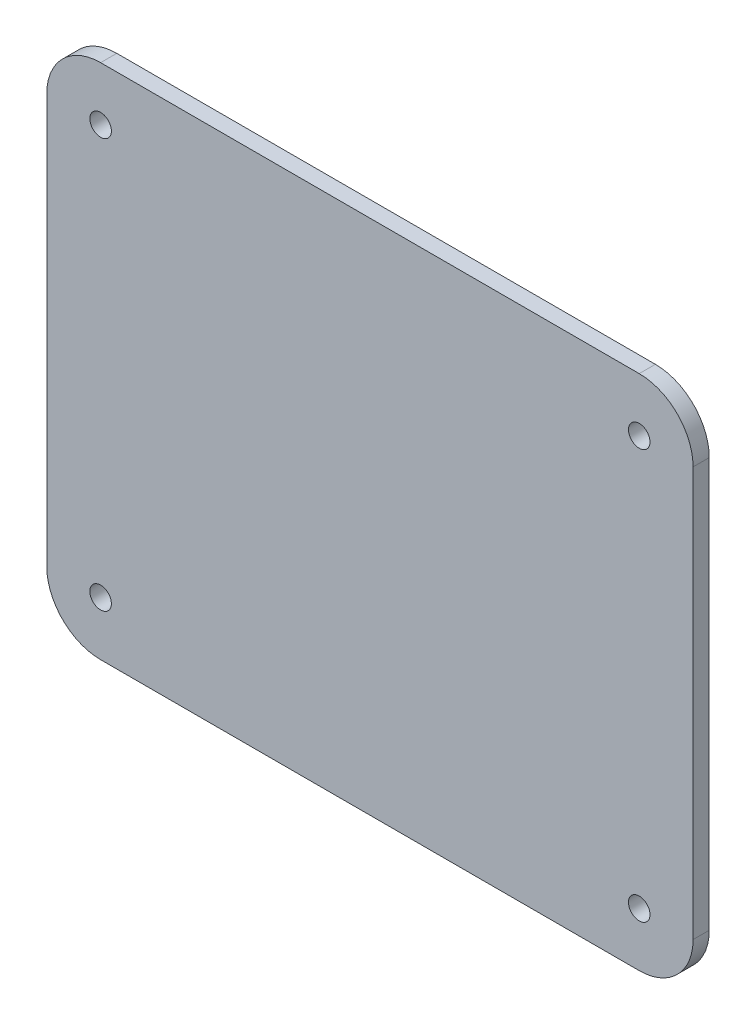
ISO-10303-21;
HEADER;
FILE_DESCRIPTION(('STEP AP214'),'2;1');
FILE_NAME('part.step','',(''),(''),'','','');
FILE_SCHEMA(('AUTOMOTIVE_DESIGN { 1 0 10303 214 1 1 1 1 }'));
ENDSEC;
DATA;
#1=APPLICATION_CONTEXT('core data for automotive mechanical design processes');
#2=APPLICATION_PROTOCOL_DEFINITION('international standard','automotive_design',2000,#1);
#3=PRODUCT_CONTEXT('',#1,'mechanical');
#4=PRODUCT('Part','Part','',(#3));
#5=PRODUCT_RELATED_PRODUCT_CATEGORY('part','',(#4));
#6=PRODUCT_DEFINITION_FORMATION('','',#4);
#7=PRODUCT_DEFINITION_CONTEXT('part definition',#1,'design');
#8=PRODUCT_DEFINITION('design','',#6,#7);
#9=PRODUCT_DEFINITION_SHAPE('','',#8);
#10=(LENGTH_UNIT() NAMED_UNIT(*) SI_UNIT(.MILLI.,.METRE.));
#11=(NAMED_UNIT(*) PLANE_ANGLE_UNIT() SI_UNIT($,.RADIAN.));
#12=(NAMED_UNIT(*) SI_UNIT($,.STERADIAN.) SOLID_ANGLE_UNIT());
#13=UNCERTAINTY_MEASURE_WITH_UNIT(LENGTH_MEASURE(1.E-05),#10,'distance_accuracy_value','');
#14=(GEOMETRIC_REPRESENTATION_CONTEXT(3) GLOBAL_UNCERTAINTY_ASSIGNED_CONTEXT((#13)) GLOBAL_UNIT_ASSIGNED_CONTEXT((#10,
#11,#12)) REPRESENTATION_CONTEXT('',''));
#15=CARTESIAN_POINT('',(0.,0.,0.));
#16=DIRECTION('',(0.,0.,1.));
#17=DIRECTION('',(1.,0.,0.));
#18=AXIS2_PLACEMENT_3D('',#15,#16,#17);
#19=CARTESIAN_POINT('',(-50.,38.,3.));
#20=DIRECTION('',(0.,0.,1.));
#21=DIRECTION('',(1.,0.,0.));
#22=AXIS2_PLACEMENT_3D('',#19,#20,#21);
#23=PLANE('',#22);
#24=CARTESIAN_POINT('',(50.,-38.,3.));
#25=DIRECTION('',(0.,0.,1.));
#26=DIRECTION('',(1.,0.,0.));
#27=AXIS2_PLACEMENT_3D('',#24,#25,#26);
#28=CIRCLE('',#27,2.);
#29=CARTESIAN_POINT('',(52.,-38.,3.));
#30=VERTEX_POINT('',#29);
#31=EDGE_CURVE('E188',#30,#30,#28,.T.);
#32=ORIENTED_EDGE('',*,*,#31,.F.);
#33=EDGE_LOOP('',(#32));
#34=FACE_BOUND('',#33,.T.);
#35=CARTESIAN_POINT('',(50.,38.,3.));
#36=DIRECTION('',(0.,0.,1.));
#37=DIRECTION('',(1.,0.,0.));
#38=AXIS2_PLACEMENT_3D('',#35,#36,#37);
#39=CIRCLE('',#38,2.);
#40=CARTESIAN_POINT('',(52.,38.,3.));
#41=VERTEX_POINT('',#40);
#42=EDGE_CURVE('E134',#41,#41,#39,.T.);
#43=ORIENTED_EDGE('',*,*,#42,.F.);
#44=EDGE_LOOP('',(#43));
#45=FACE_BOUND('',#44,.T.);
#46=CARTESIAN_POINT('',(-50.,38.,3.));
#47=DIRECTION('',(0.,0.,1.));
#48=DIRECTION('',(1.,0.,0.));
#49=AXIS2_PLACEMENT_3D('',#46,#47,#48);
#50=CIRCLE('',#49,10.);
#51=CARTESIAN_POINT('',(-49.9999999999999,48.,3.));
#52=VERTEX_POINT('',#51);
#53=CARTESIAN_POINT('',(-60.,37.9999999999999,3.));
#54=VERTEX_POINT('',#53);
#55=EDGE_CURVE('E145',#52,#54,#50,.T.);
#56=ORIENTED_EDGE('',*,*,#55,.T.);
#57=DIRECTION('',(0.,-1.,0.));
#58=VECTOR('',#57,1.);
#59=CARTESIAN_POINT('',(-60.,37.9999999999999,3.));
#60=LINE('',#59,#58);
#61=CARTESIAN_POINT('',(-60.,-37.9999999999999,3.));
#62=VERTEX_POINT('',#61);
#63=EDGE_CURVE('E93',#54,#62,#60,.T.);
#64=ORIENTED_EDGE('',*,*,#63,.T.);
#65=CARTESIAN_POINT('',(-50.,-38.,3.));
#66=DIRECTION('',(0.,0.,1.));
#67=DIRECTION('',(1.,0.,0.));
#68=AXIS2_PLACEMENT_3D('',#65,#66,#67);
#69=CIRCLE('',#68,10.);
#70=CARTESIAN_POINT('',(-49.9999999999999,-48.,3.));
#71=VERTEX_POINT('',#70);
#72=EDGE_CURVE('E160',#62,#71,#69,.T.);
#73=ORIENTED_EDGE('',*,*,#72,.T.);
#74=DIRECTION('',(1.,0.,0.));
#75=VECTOR('',#74,1.);
#76=CARTESIAN_POINT('',(-49.9999999999999,-48.,3.));
#77=LINE('',#76,#75);
#78=CARTESIAN_POINT('',(49.9999999999999,-48.,3.));
#79=VERTEX_POINT('',#78);
#80=EDGE_CURVE('E173',#71,#79,#77,.T.);
#81=ORIENTED_EDGE('',*,*,#80,.T.);
#82=CARTESIAN_POINT('',(50.,-38.,3.));
#83=DIRECTION('',(0.,0.,1.));
#84=DIRECTION('',(1.,0.,0.));
#85=AXIS2_PLACEMENT_3D('',#82,#83,#84);
#86=CIRCLE('',#85,10.);
#87=CARTESIAN_POINT('',(60.,-37.9999999999999,3.));
#88=VERTEX_POINT('',#87);
#89=EDGE_CURVE('E112',#79,#88,#86,.T.);
#90=ORIENTED_EDGE('',*,*,#89,.T.);
#91=DIRECTION('',(0.,1.,0.));
#92=VECTOR('',#91,1.);
#93=CARTESIAN_POINT('',(60.,37.9999999999999,3.));
#94=LINE('',#93,#92);
#95=CARTESIAN_POINT('',(60.,37.9999999999999,3.));
#96=VERTEX_POINT('',#95);
#97=EDGE_CURVE('E106',#88,#96,#94,.T.);
#98=ORIENTED_EDGE('',*,*,#97,.T.);
#99=CARTESIAN_POINT('',(50.,38.,3.));
#100=DIRECTION('',(0.,0.,1.));
#101=DIRECTION('',(-1.,0.,0.));
#102=AXIS2_PLACEMENT_3D('',#99,#100,#101);
#103=CIRCLE('',#102,10.);
#104=CARTESIAN_POINT('',(49.9999999999999,48.,3.));
#105=VERTEX_POINT('',#104);
#106=EDGE_CURVE('E110',#96,#105,#103,.T.);
#107=ORIENTED_EDGE('',*,*,#106,.T.);
#108=DIRECTION('',(-1.,0.,0.));
#109=VECTOR('',#108,1.);
#110=CARTESIAN_POINT('',(-49.9999999999999,48.,3.));
#111=LINE('',#110,#109);
#112=EDGE_CURVE('E50',#105,#52,#111,.T.);
#113=ORIENTED_EDGE('',*,*,#112,.T.);
#114=EDGE_LOOP('',(#56,#64,#73,#81,#90,#98,#107,#113));
#115=FACE_BOUND('',#114,.T.);
#116=CARTESIAN_POINT('',(-50.,38.,3.));
#117=DIRECTION('',(0.,0.,1.));
#118=DIRECTION('',(1.,0.,0.));
#119=AXIS2_PLACEMENT_3D('',#116,#117,#118);
#120=CIRCLE('',#119,2.);
#121=CARTESIAN_POINT('',(-48.,38.,3.));
#122=VERTEX_POINT('',#121);
#123=EDGE_CURVE('E182',#122,#122,#120,.T.);
#124=ORIENTED_EDGE('',*,*,#123,.F.);
#125=EDGE_LOOP('',(#124));
#126=FACE_BOUND('',#125,.T.);
#127=CARTESIAN_POINT('',(-50.,-38.,3.));
#128=DIRECTION('',(0.,0.,1.));
#129=DIRECTION('',(1.,0.,0.));
#130=AXIS2_PLACEMENT_3D('',#127,#128,#129);
#131=CIRCLE('',#130,2.);
#132=CARTESIAN_POINT('',(-48.,-38.,3.));
#133=VERTEX_POINT('',#132);
#134=EDGE_CURVE('E194',#133,#133,#131,.T.);
#135=ORIENTED_EDGE('',*,*,#134,.F.);
#136=EDGE_LOOP('',(#135));
#137=FACE_BOUND('',#136,.T.);
#138=ADVANCED_FACE('F33',(#34,#45,#115,#126,#137),#23,.T.);
#139=CARTESIAN_POINT('',(-50.,38.,0.));
#140=DIRECTION('',(0.,0.,1.));
#141=DIRECTION('',(1.,0.,0.));
#142=AXIS2_PLACEMENT_3D('',#139,#140,#141);
#143=PLANE('',#142);
#144=CARTESIAN_POINT('',(-50.,38.,0.));
#145=DIRECTION('',(0.,0.,1.));
#146=DIRECTION('',(1.,0.,0.));
#147=AXIS2_PLACEMENT_3D('',#144,#145,#146);
#148=CIRCLE('',#147,10.);
#149=CARTESIAN_POINT('',(-49.9999999999999,48.,0.));
#150=VERTEX_POINT('',#149);
#151=CARTESIAN_POINT('',(-60.,37.9999999999999,0.));
#152=VERTEX_POINT('',#151);
#153=EDGE_CURVE('E130',#150,#152,#148,.T.);
#154=ORIENTED_EDGE('',*,*,#153,.F.);
#155=DIRECTION('',(-1.,0.,0.));
#156=VECTOR('',#155,1.);
#157=CARTESIAN_POINT('',(-49.9999999999999,48.,0.));
#158=LINE('',#157,#156);
#159=CARTESIAN_POINT('',(49.9999999999999,48.,0.));
#160=VERTEX_POINT('',#159);
#161=EDGE_CURVE('E85',#160,#150,#158,.T.);
#162=ORIENTED_EDGE('',*,*,#161,.F.);
#163=CARTESIAN_POINT('',(50.,38.,0.));
#164=DIRECTION('',(0.,0.,1.));
#165=DIRECTION('',(-1.,0.,0.));
#166=AXIS2_PLACEMENT_3D('',#163,#164,#165);
#167=CIRCLE('',#166,10.);
#168=CARTESIAN_POINT('',(60.,37.9999999999999,0.));
#169=VERTEX_POINT('',#168);
#170=EDGE_CURVE('E79',#169,#160,#167,.T.);
#171=ORIENTED_EDGE('',*,*,#170,.F.);
#172=DIRECTION('',(0.,1.,0.));
#173=VECTOR('',#172,1.);
#174=CARTESIAN_POINT('',(60.,37.9999999999999,0.));
#175=LINE('',#174,#173);
#176=CARTESIAN_POINT('',(60.,-37.9999999999999,0.));
#177=VERTEX_POINT('',#176);
#178=EDGE_CURVE('E120',#177,#169,#175,.T.);
#179=ORIENTED_EDGE('',*,*,#178,.F.);
#180=CARTESIAN_POINT('',(50.,-38.,0.));
#181=DIRECTION('',(0.,0.,1.));
#182=DIRECTION('',(1.,0.,0.));
#183=AXIS2_PLACEMENT_3D('',#180,#181,#182);
#184=CIRCLE('',#183,10.);
#185=CARTESIAN_POINT('',(49.9999999999999,-48.,0.));
#186=VERTEX_POINT('',#185);
#187=EDGE_CURVE('E140',#186,#177,#184,.T.);
#188=ORIENTED_EDGE('',*,*,#187,.F.);
#189=DIRECTION('',(1.,0.,0.));
#190=VECTOR('',#189,1.);
#191=CARTESIAN_POINT('',(-49.9999999999999,-48.,0.));
#192=LINE('',#191,#190);
#193=CARTESIAN_POINT('',(-49.9999999999999,-48.,0.));
#194=VERTEX_POINT('',#193);
#195=EDGE_CURVE('E138',#194,#186,#192,.T.);
#196=ORIENTED_EDGE('',*,*,#195,.F.);
#197=CARTESIAN_POINT('',(-50.,-38.,0.));
#198=DIRECTION('',(0.,0.,1.));
#199=DIRECTION('',(1.,0.,0.));
#200=AXIS2_PLACEMENT_3D('',#197,#198,#199);
#201=CIRCLE('',#200,10.);
#202=CARTESIAN_POINT('',(-60.,-37.9999999999999,0.));
#203=VERTEX_POINT('',#202);
#204=EDGE_CURVE('E136',#203,#194,#201,.T.);
#205=ORIENTED_EDGE('',*,*,#204,.F.);
#206=DIRECTION('',(0.,-1.,0.));
#207=VECTOR('',#206,1.);
#208=CARTESIAN_POINT('',(-60.,37.9999999999999,0.));
#209=LINE('',#208,#207);
#210=EDGE_CURVE('E133',#152,#203,#209,.T.);
#211=ORIENTED_EDGE('',*,*,#210,.F.);
#212=EDGE_LOOP('',(#154,#162,#171,#179,#188,#196,#205,#211));
#213=FACE_BOUND('',#212,.T.);
#214=CARTESIAN_POINT('',(50.,38.,0.));
#215=DIRECTION('',(0.,0.,1.));
#216=DIRECTION('',(1.,0.,0.));
#217=AXIS2_PLACEMENT_3D('',#214,#215,#216);
#218=CIRCLE('',#217,2.);
#219=CARTESIAN_POINT('',(52.,38.,0.));
#220=VERTEX_POINT('',#219);
#221=EDGE_CURVE('E179',#220,#220,#218,.T.);
#222=ORIENTED_EDGE('',*,*,#221,.T.);
#223=EDGE_LOOP('',(#222));
#224=FACE_BOUND('',#223,.T.);
#225=CARTESIAN_POINT('',(-50.,38.,0.));
#226=DIRECTION('',(0.,0.,1.));
#227=DIRECTION('',(1.,0.,0.));
#228=AXIS2_PLACEMENT_3D('',#225,#226,#227);
#229=CIRCLE('',#228,2.);
#230=CARTESIAN_POINT('',(-48.,38.,0.));
#231=VERTEX_POINT('',#230);
#232=EDGE_CURVE('E185',#231,#231,#229,.T.);
#233=ORIENTED_EDGE('',*,*,#232,.T.);
#234=EDGE_LOOP('',(#233));
#235=FACE_BOUND('',#234,.T.);
#236=CARTESIAN_POINT('',(50.,-38.,0.));
#237=DIRECTION('',(0.,0.,1.));
#238=DIRECTION('',(1.,0.,0.));
#239=AXIS2_PLACEMENT_3D('',#236,#237,#238);
#240=CIRCLE('',#239,2.);
#241=CARTESIAN_POINT('',(52.,-38.,0.));
#242=VERTEX_POINT('',#241);
#243=EDGE_CURVE('E191',#242,#242,#240,.T.);
#244=ORIENTED_EDGE('',*,*,#243,.T.);
#245=EDGE_LOOP('',(#244));
#246=FACE_BOUND('',#245,.T.);
#247=CARTESIAN_POINT('',(-50.,-38.,0.));
#248=DIRECTION('',(0.,0.,1.));
#249=DIRECTION('',(1.,0.,0.));
#250=AXIS2_PLACEMENT_3D('',#247,#248,#249);
#251=CIRCLE('',#250,2.);
#252=CARTESIAN_POINT('',(-48.,-38.,0.));
#253=VERTEX_POINT('',#252);
#254=EDGE_CURVE('E197',#253,#253,#251,.T.);
#255=ORIENTED_EDGE('',*,*,#254,.T.);
#256=EDGE_LOOP('',(#255));
#257=FACE_BOUND('',#256,.T.);
#258=ADVANCED_FACE('F164',(#213,#224,#235,#246,#257),#143,.F.);
#259=CARTESIAN_POINT('',(-50.,38.,3.));
#260=DIRECTION('',(0.,0.,-1.));
#261=DIRECTION('',(-1.,0.,0.));
#262=AXIS2_PLACEMENT_3D('',#259,#260,#261);
#263=CYLINDRICAL_SURFACE('',#262,10.);
#264=ORIENTED_EDGE('',*,*,#153,.T.);
#265=DIRECTION('',(0.,0.,-1.));
#266=VECTOR('',#265,1.);
#267=CARTESIAN_POINT('',(-60.,37.9999999999999,3.));
#268=LINE('',#267,#266);
#269=EDGE_CURVE('E11',#54,#152,#268,.T.);
#270=ORIENTED_EDGE('',*,*,#269,.F.);
#271=ORIENTED_EDGE('',*,*,#55,.F.);
#272=DIRECTION('',(0.,0.,-1.));
#273=VECTOR('',#272,1.);
#274=CARTESIAN_POINT('',(-49.9999999999999,48.,3.));
#275=LINE('',#274,#273);
#276=EDGE_CURVE('E126',#52,#150,#275,.T.);
#277=ORIENTED_EDGE('',*,*,#276,.T.);
#278=EDGE_LOOP('',(#264,#270,#271,#277));
#279=FACE_BOUND('',#278,.T.);
#280=ADVANCED_FACE('F35',(#279),#263,.T.);
#281=CARTESIAN_POINT('',(-60.,37.9999999999999,3.));
#282=DIRECTION('',(1.,0.,0.));
#283=DIRECTION('',(0.,1.,0.));
#284=AXIS2_PLACEMENT_3D('',#281,#282,#283);
#285=PLANE('',#284);
#286=ORIENTED_EDGE('',*,*,#210,.T.);
#287=DIRECTION('',(0.,0.,-1.));
#288=VECTOR('',#287,1.);
#289=CARTESIAN_POINT('',(-60.,-37.9999999999999,3.));
#290=LINE('',#289,#288);
#291=EDGE_CURVE('E42',#62,#203,#290,.T.);
#292=ORIENTED_EDGE('',*,*,#291,.F.);
#293=ORIENTED_EDGE('',*,*,#63,.F.);
#294=ORIENTED_EDGE('',*,*,#269,.T.);
#295=EDGE_LOOP('',(#286,#292,#293,#294));
#296=FACE_BOUND('',#295,.T.);
#297=ADVANCED_FACE('F231',(#296),#285,.F.);
#298=CARTESIAN_POINT('',(-50.,-38.,3.));
#299=DIRECTION('',(0.,0.,-1.));
#300=DIRECTION('',(-1.,0.,0.));
#301=AXIS2_PLACEMENT_3D('',#298,#299,#300);
#302=CYLINDRICAL_SURFACE('',#301,10.);
#303=ORIENTED_EDGE('',*,*,#204,.T.);
#304=DIRECTION('',(0.,0.,-1.));
#305=VECTOR('',#304,1.);
#306=CARTESIAN_POINT('',(-49.9999999999999,-48.,3.));
#307=LINE('',#306,#305);
#308=EDGE_CURVE('E152',#71,#194,#307,.T.);
#309=ORIENTED_EDGE('',*,*,#308,.F.);
#310=ORIENTED_EDGE('',*,*,#72,.F.);
#311=ORIENTED_EDGE('',*,*,#291,.T.);
#312=EDGE_LOOP('',(#303,#309,#310,#311));
#313=FACE_BOUND('',#312,.T.);
#314=ADVANCED_FACE('F158',(#313),#302,.T.);
#315=CARTESIAN_POINT('',(-49.9999999999999,-48.,3.));
#316=DIRECTION('',(0.,1.,0.));
#317=DIRECTION('',(0.,0.,1.));
#318=AXIS2_PLACEMENT_3D('',#315,#316,#317);
#319=PLANE('',#318);
#320=ORIENTED_EDGE('',*,*,#195,.T.);
#321=DIRECTION('',(0.,0.,-1.));
#322=VECTOR('',#321,1.);
#323=CARTESIAN_POINT('',(49.9999999999999,-48.,3.));
#324=LINE('',#323,#322);
#325=EDGE_CURVE('E149',#79,#186,#324,.T.);
#326=ORIENTED_EDGE('',*,*,#325,.F.);
#327=ORIENTED_EDGE('',*,*,#80,.F.);
#328=ORIENTED_EDGE('',*,*,#308,.T.);
#329=EDGE_LOOP('',(#320,#326,#327,#328));
#330=FACE_BOUND('',#329,.T.);
#331=ADVANCED_FACE('F169',(#330),#319,.F.);
#332=CARTESIAN_POINT('',(50.,-38.,3.));
#333=DIRECTION('',(0.,0.,-1.));
#334=DIRECTION('',(-1.,0.,0.));
#335=AXIS2_PLACEMENT_3D('',#332,#333,#334);
#336=CYLINDRICAL_SURFACE('',#335,10.);
#337=ORIENTED_EDGE('',*,*,#187,.T.);
#338=DIRECTION('',(0.,0.,-1.));
#339=VECTOR('',#338,1.);
#340=CARTESIAN_POINT('',(60.,-37.9999999999999,3.));
#341=LINE('',#340,#339);
#342=EDGE_CURVE('E121',#88,#177,#341,.T.);
#343=ORIENTED_EDGE('',*,*,#342,.F.);
#344=ORIENTED_EDGE('',*,*,#89,.F.);
#345=ORIENTED_EDGE('',*,*,#325,.T.);
#346=EDGE_LOOP('',(#337,#343,#344,#345));
#347=FACE_BOUND('',#346,.T.);
#348=ADVANCED_FACE('F172',(#347),#336,.T.);
#349=CARTESIAN_POINT('',(60.,37.9999999999999,3.));
#350=DIRECTION('',(-1.,0.,0.));
#351=DIRECTION('',(0.,-1.,0.));
#352=AXIS2_PLACEMENT_3D('',#349,#350,#351);
#353=PLANE('',#352);
#354=ORIENTED_EDGE('',*,*,#178,.T.);
#355=DIRECTION('',(0.,0.,-1.));
#356=VECTOR('',#355,1.);
#357=CARTESIAN_POINT('',(60.,37.9999999999999,3.));
#358=LINE('',#357,#356);
#359=EDGE_CURVE('E117',#96,#169,#358,.T.);
#360=ORIENTED_EDGE('',*,*,#359,.F.);
#361=ORIENTED_EDGE('',*,*,#97,.F.);
#362=ORIENTED_EDGE('',*,*,#342,.T.);
#363=EDGE_LOOP('',(#354,#360,#361,#362));
#364=FACE_BOUND('',#363,.T.);
#365=ADVANCED_FACE('F118',(#364),#353,.F.);
#366=CARTESIAN_POINT('',(50.,38.,3.));
#367=DIRECTION('',(0.,0.,-1.));
#368=DIRECTION('',(-1.,0.,0.));
#369=AXIS2_PLACEMENT_3D('',#366,#367,#368);
#370=CYLINDRICAL_SURFACE('',#369,10.);
#371=ORIENTED_EDGE('',*,*,#170,.T.);
#372=DIRECTION('',(0.,0.,-1.));
#373=VECTOR('',#372,1.);
#374=CARTESIAN_POINT('',(49.9999999999999,48.,3.));
#375=LINE('',#374,#373);
#376=EDGE_CURVE('E122',#105,#160,#375,.T.);
#377=ORIENTED_EDGE('',*,*,#376,.F.);
#378=ORIENTED_EDGE('',*,*,#106,.F.);
#379=ORIENTED_EDGE('',*,*,#359,.T.);
#380=EDGE_LOOP('',(#371,#377,#378,#379));
#381=FACE_BOUND('',#380,.T.);
#382=ADVANCED_FACE('F124',(#381),#370,.T.);
#383=CARTESIAN_POINT('',(-49.9999999999999,48.,3.));
#384=DIRECTION('',(0.,-1.,0.));
#385=DIRECTION('',(0.,0.,-1.));
#386=AXIS2_PLACEMENT_3D('',#383,#384,#385);
#387=PLANE('',#386);
#388=ORIENTED_EDGE('',*,*,#161,.T.);
#389=ORIENTED_EDGE('',*,*,#276,.F.);
#390=ORIENTED_EDGE('',*,*,#112,.F.);
#391=ORIENTED_EDGE('',*,*,#376,.T.);
#392=EDGE_LOOP('',(#388,#389,#390,#391));
#393=FACE_BOUND('',#392,.T.);
#394=ADVANCED_FACE('F219',(#393),#387,.F.);
#395=CARTESIAN_POINT('',(50.,38.,3.));
#396=DIRECTION('',(0.,0.,-1.));
#397=DIRECTION('',(-1.,0.,0.));
#398=AXIS2_PLACEMENT_3D('',#395,#396,#397);
#399=CYLINDRICAL_SURFACE('',#398,2.);
#400=ORIENTED_EDGE('',*,*,#42,.T.);
#401=EDGE_LOOP('',(#400));
#402=FACE_BOUND('',#401,.T.);
#403=ORIENTED_EDGE('',*,*,#221,.F.);
#404=EDGE_LOOP('',(#403));
#405=FACE_BOUND('',#404,.T.);
#406=ADVANCED_FACE('F216',(#402,#405),#399,.F.);
#407=CARTESIAN_POINT('',(-50.,38.,3.));
#408=DIRECTION('',(0.,0.,-1.));
#409=DIRECTION('',(-1.,0.,0.));
#410=AXIS2_PLACEMENT_3D('',#407,#408,#409);
#411=CYLINDRICAL_SURFACE('',#410,2.);
#412=ORIENTED_EDGE('',*,*,#123,.T.);
#413=EDGE_LOOP('',(#412));
#414=FACE_BOUND('',#413,.T.);
#415=ORIENTED_EDGE('',*,*,#232,.F.);
#416=EDGE_LOOP('',(#415));
#417=FACE_BOUND('',#416,.T.);
#418=ADVANCED_FACE('F295',(#414,#417),#411,.F.);
#419=CARTESIAN_POINT('',(50.,-38.,3.));
#420=DIRECTION('',(0.,0.,-1.));
#421=DIRECTION('',(-1.,0.,0.));
#422=AXIS2_PLACEMENT_3D('',#419,#420,#421);
#423=CYLINDRICAL_SURFACE('',#422,2.);
#424=ORIENTED_EDGE('',*,*,#31,.T.);
#425=EDGE_LOOP('',(#424));
#426=FACE_BOUND('',#425,.T.);
#427=ORIENTED_EDGE('',*,*,#243,.F.);
#428=EDGE_LOOP('',(#427));
#429=FACE_BOUND('',#428,.T.);
#430=ADVANCED_FACE('F303',(#426,#429),#423,.F.);
#431=CARTESIAN_POINT('',(-50.,-38.,3.));
#432=DIRECTION('',(0.,0.,-1.));
#433=DIRECTION('',(-1.,0.,0.));
#434=AXIS2_PLACEMENT_3D('',#431,#432,#433);
#435=CYLINDRICAL_SURFACE('',#434,2.);
#436=ORIENTED_EDGE('',*,*,#134,.T.);
#437=EDGE_LOOP('',(#436));
#438=FACE_BOUND('',#437,.T.);
#439=ORIENTED_EDGE('',*,*,#254,.F.);
#440=EDGE_LOOP('',(#439));
#441=FACE_BOUND('',#440,.T.);
#442=ADVANCED_FACE('F203',(#438,#441),#435,.F.);
#443=CLOSED_SHELL('',(#138,#258,#280,#297,#314,#331,#348,#365,#382,#394,#406,#418,#430,#442));
#444=MANIFOLD_SOLID_BREP('B2',#443);
#445=ADVANCED_BREP_SHAPE_REPRESENTATION('',(#18,#444),#14);
#446=SHAPE_DEFINITION_REPRESENTATION(#9,#445);
ENDSEC;
END-ISO-10303-21;
